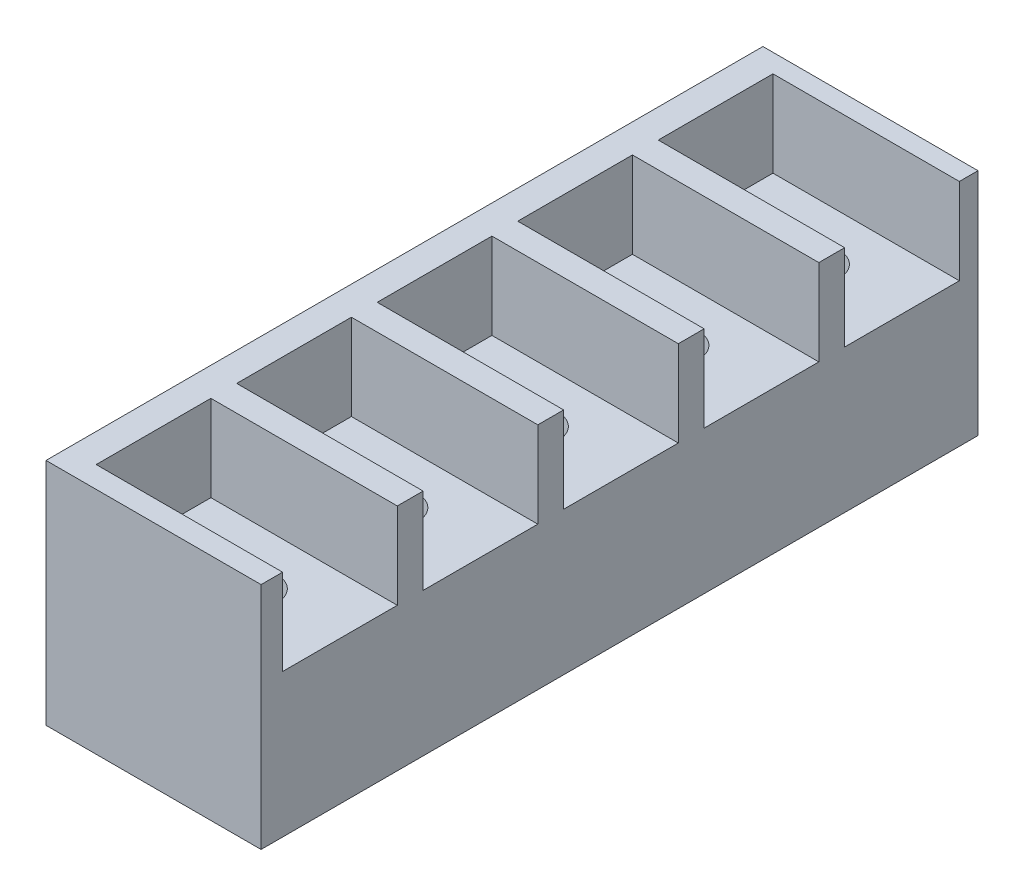
ISO-10303-21;
HEADER;
FILE_DESCRIPTION(('STEP AP214'),'2;1');
FILE_NAME('part.step','',(''),(''),'','','');
FILE_SCHEMA(('AUTOMOTIVE_DESIGN { 1 0 10303 214 1 1 1 1 }'));
ENDSEC;
DATA;
#1=APPLICATION_CONTEXT('core data for automotive mechanical design processes');
#2=APPLICATION_PROTOCOL_DEFINITION('international standard','automotive_design',2000,#1);
#3=PRODUCT_CONTEXT('',#1,'mechanical');
#4=PRODUCT('Part','Part','',(#3));
#5=PRODUCT_RELATED_PRODUCT_CATEGORY('part','',(#4));
#6=PRODUCT_DEFINITION_FORMATION('','',#4);
#7=PRODUCT_DEFINITION_CONTEXT('part definition',#1,'design');
#8=PRODUCT_DEFINITION('design','',#6,#7);
#9=PRODUCT_DEFINITION_SHAPE('','',#8);
#10=(LENGTH_UNIT() NAMED_UNIT(*) SI_UNIT(.MILLI.,.METRE.));
#11=(NAMED_UNIT(*) PLANE_ANGLE_UNIT() SI_UNIT($,.RADIAN.));
#12=(NAMED_UNIT(*) SI_UNIT($,.STERADIAN.) SOLID_ANGLE_UNIT());
#13=UNCERTAINTY_MEASURE_WITH_UNIT(LENGTH_MEASURE(1.E-05),#10,'distance_accuracy_value','');
#14=(GEOMETRIC_REPRESENTATION_CONTEXT(3) GLOBAL_UNCERTAINTY_ASSIGNED_CONTEXT((#13)) GLOBAL_UNIT_ASSIGNED_CONTEXT((#10,
#11,#12)) REPRESENTATION_CONTEXT('',''));
#15=CARTESIAN_POINT('',(0.,0.,0.));
#16=DIRECTION('',(0.,0.,1.));
#17=DIRECTION('',(1.,0.,0.));
#18=AXIS2_PLACEMENT_3D('',#15,#16,#17);
#19=CARTESIAN_POINT('',(0.,16.,0.));
#20=DIRECTION('',(1.,0.,0.));
#21=DIRECTION('',(0.,0.,-1.));
#22=AXIS2_PLACEMENT_3D('',#19,#20,#21);
#23=PLANE('',#22);
#24=DIRECTION('',(0.,0.,1.));
#25=VECTOR('',#24,1.);
#26=CARTESIAN_POINT('',(0.,0.,0.));
#27=LINE('',#26,#25);
#28=CARTESIAN_POINT('',(0.,0.,-50.));
#29=VERTEX_POINT('',#28);
#30=CARTESIAN_POINT('',(0.,0.,0.));
#31=VERTEX_POINT('',#30);
#32=EDGE_CURVE('E274',#29,#31,#27,.T.);
#33=ORIENTED_EDGE('',*,*,#32,.T.);
#34=DIRECTION('',(0.,-1.,0.));
#35=VECTOR('',#34,1.);
#36=CARTESIAN_POINT('',(0.,16.,0.));
#37=LINE('',#36,#35);
#38=CARTESIAN_POINT('',(0.,16.,0.));
#39=VERTEX_POINT('',#38);
#40=EDGE_CURVE('E11',#39,#31,#37,.T.);
#41=ORIENTED_EDGE('',*,*,#40,.F.);
#42=DIRECTION('',(0.,0.,1.));
#43=VECTOR('',#42,1.);
#44=CARTESIAN_POINT('',(0.,16.,0.));
#45=LINE('',#44,#43);
#46=CARTESIAN_POINT('',(0.,16.,-50.));
#47=VERTEX_POINT('',#46);
#48=EDGE_CURVE('E390',#47,#39,#45,.T.);
#49=ORIENTED_EDGE('',*,*,#48,.F.);
#50=DIRECTION('',(0.,-1.,0.));
#51=VECTOR('',#50,1.);
#52=CARTESIAN_POINT('',(0.,16.,-50.));
#53=LINE('',#52,#51);
#54=EDGE_CURVE('E403',#47,#29,#53,.T.);
#55=ORIENTED_EDGE('',*,*,#54,.T.);
#56=EDGE_LOOP('',(#33,#41,#49,#55));
#57=FACE_BOUND('',#56,.T.);
#58=ADVANCED_FACE('F34',(#57),#23,.F.);
#59=CARTESIAN_POINT('',(0.,16.,0.));
#60=DIRECTION('',(0.,0.,-1.));
#61=DIRECTION('',(-1.,0.,0.));
#62=AXIS2_PLACEMENT_3D('',#59,#60,#61);
#63=PLANE('',#62);
#64=DIRECTION('',(1.,0.,0.));
#65=VECTOR('',#64,1.);
#66=CARTESIAN_POINT('',(0.,0.,0.));
#67=LINE('',#66,#65);
#68=CARTESIAN_POINT('',(15.,0.,0.));
#69=VERTEX_POINT('',#68);
#70=EDGE_CURVE('E406',#31,#69,#67,.T.);
#71=ORIENTED_EDGE('',*,*,#70,.T.);
#72=DIRECTION('',(0.,-1.,0.));
#73=VECTOR('',#72,1.);
#74=CARTESIAN_POINT('',(15.,16.,0.));
#75=LINE('',#74,#73);
#76=CARTESIAN_POINT('',(15.,16.,0.));
#77=VERTEX_POINT('',#76);
#78=EDGE_CURVE('E41',#77,#69,#75,.T.);
#79=ORIENTED_EDGE('',*,*,#78,.F.);
#80=DIRECTION('',(1.,0.,0.));
#81=VECTOR('',#80,1.);
#82=CARTESIAN_POINT('',(0.,16.,0.));
#83=LINE('',#82,#81);
#84=EDGE_CURVE('E393',#39,#77,#83,.T.);
#85=ORIENTED_EDGE('',*,*,#84,.F.);
#86=ORIENTED_EDGE('',*,*,#40,.T.);
#87=EDGE_LOOP('',(#71,#79,#85,#86));
#88=FACE_BOUND('',#87,.T.);
#89=ADVANCED_FACE('F514',(#88),#63,.F.);
#90=CARTESIAN_POINT('',(15.,16.,0.));
#91=DIRECTION('',(-1.,0.,0.));
#92=DIRECTION('',(0.,0.,1.));
#93=AXIS2_PLACEMENT_3D('',#90,#91,#92);
#94=PLANE('',#93);
#95=DIRECTION('',(0.,0.,-1.));
#96=VECTOR('',#95,1.);
#97=CARTESIAN_POINT('',(15.,10.,-1.5));
#98=LINE('',#97,#96);
#99=CARTESIAN_POINT('',(15.,10.,-1.5));
#100=VERTEX_POINT('',#99);
#101=CARTESIAN_POINT('',(15.,10.,-9.5));
#102=VERTEX_POINT('',#101);
#103=EDGE_CURVE('E249',#100,#102,#98,.T.);
#104=ORIENTED_EDGE('',*,*,#103,.F.);
#105=DIRECTION('',(0.,1.,0.));
#106=VECTOR('',#105,1.);
#107=CARTESIAN_POINT('',(15.,10.,-1.5));
#108=LINE('',#107,#106);
#109=CARTESIAN_POINT('',(15.,16.,-1.5));
#110=VERTEX_POINT('',#109);
#111=EDGE_CURVE('E271',#100,#110,#108,.T.);
#112=ORIENTED_EDGE('',*,*,#111,.T.);
#113=DIRECTION('',(0.,0.,-1.));
#114=VECTOR('',#113,1.);
#115=CARTESIAN_POINT('',(15.,16.,0.));
#116=LINE('',#115,#114);
#117=EDGE_CURVE('E397',#77,#110,#116,.T.);
#118=ORIENTED_EDGE('',*,*,#117,.F.);
#119=ORIENTED_EDGE('',*,*,#78,.T.);
#120=DIRECTION('',(0.,0.,-1.));
#121=VECTOR('',#120,1.);
#122=CARTESIAN_POINT('',(15.,0.,0.));
#123=LINE('',#122,#121);
#124=CARTESIAN_POINT('',(15.,0.,-50.));
#125=VERTEX_POINT('',#124);
#126=EDGE_CURVE('E408',#69,#125,#123,.T.);
#127=ORIENTED_EDGE('',*,*,#126,.T.);
#128=DIRECTION('',(0.,-1.,0.));
#129=VECTOR('',#128,1.);
#130=CARTESIAN_POINT('',(15.,16.,-50.));
#131=LINE('',#130,#129);
#132=CARTESIAN_POINT('',(15.,16.,-50.));
#133=VERTEX_POINT('',#132);
#134=EDGE_CURVE('E413',#133,#125,#131,.T.);
#135=ORIENTED_EDGE('',*,*,#134,.F.);
#136=CARTESIAN_POINT('',(15.,16.,-48.7));
#137=VERTEX_POINT('',#136);
#138=EDGE_CURVE('E396',#137,#133,#116,.T.);
#139=ORIENTED_EDGE('',*,*,#138,.F.);
#140=DIRECTION('',(0.,1.,0.));
#141=VECTOR('',#140,1.);
#142=CARTESIAN_POINT('',(14.9999999999999,10.,-48.7));
#143=LINE('',#142,#141);
#144=CARTESIAN_POINT('',(14.9999999999999,10.,-48.7));
#145=VERTEX_POINT('',#144);
#146=EDGE_CURVE('E48',#145,#137,#143,.T.);
#147=ORIENTED_EDGE('',*,*,#146,.F.);
#148=DIRECTION('',(0.,0.,-1.));
#149=VECTOR('',#148,1.);
#150=CARTESIAN_POINT('',(14.9999999999999,10.,-40.7));
#151=LINE('',#150,#149);
#152=CARTESIAN_POINT('',(14.9999999999999,10.,-40.7));
#153=VERTEX_POINT('',#152);
#154=EDGE_CURVE('E368',#153,#145,#151,.T.);
#155=ORIENTED_EDGE('',*,*,#154,.F.);
#156=DIRECTION('',(0.,1.,0.));
#157=VECTOR('',#156,1.);
#158=CARTESIAN_POINT('',(14.9999999999999,10.,-40.7));
#159=LINE('',#158,#157);
#160=CARTESIAN_POINT('',(14.9999999999999,16.,-40.7));
#161=VERTEX_POINT('',#160);
#162=EDGE_CURVE('E378',#153,#161,#159,.T.);
#163=ORIENTED_EDGE('',*,*,#162,.T.);
#164=CARTESIAN_POINT('',(15.,16.,-38.9));
#165=VERTEX_POINT('',#164);
#166=EDGE_CURVE('E439',#165,#161,#116,.T.);
#167=ORIENTED_EDGE('',*,*,#166,.F.);
#168=DIRECTION('',(0.,1.,0.));
#169=VECTOR('',#168,1.);
#170=CARTESIAN_POINT('',(14.9999999999999,10.,-38.9));
#171=LINE('',#170,#169);
#172=CARTESIAN_POINT('',(14.9999999999999,10.,-38.9));
#173=VERTEX_POINT('',#172);
#174=EDGE_CURVE('E56',#173,#165,#171,.T.);
#175=ORIENTED_EDGE('',*,*,#174,.F.);
#176=DIRECTION('',(0.,0.,-1.));
#177=VECTOR('',#176,1.);
#178=CARTESIAN_POINT('',(14.9999999999999,10.,-30.9));
#179=LINE('',#178,#177);
#180=CARTESIAN_POINT('',(14.9999999999999,10.,-30.9));
#181=VERTEX_POINT('',#180);
#182=EDGE_CURVE('E341',#181,#173,#179,.T.);
#183=ORIENTED_EDGE('',*,*,#182,.F.);
#184=DIRECTION('',(0.,1.,0.));
#185=VECTOR('',#184,1.);
#186=CARTESIAN_POINT('',(14.9999999999999,10.,-30.9));
#187=LINE('',#186,#185);
#188=CARTESIAN_POINT('',(14.9999999999999,16.,-30.9));
#189=VERTEX_POINT('',#188);
#190=EDGE_CURVE('E351',#181,#189,#187,.T.);
#191=ORIENTED_EDGE('',*,*,#190,.T.);
#192=CARTESIAN_POINT('',(15.,16.,-29.1));
#193=VERTEX_POINT('',#192);
#194=EDGE_CURVE('E441',#193,#189,#116,.T.);
#195=ORIENTED_EDGE('',*,*,#194,.F.);
#196=DIRECTION('',(0.,1.,0.));
#197=VECTOR('',#196,1.);
#198=CARTESIAN_POINT('',(14.9999999999999,10.,-29.1));
#199=LINE('',#198,#197);
#200=CARTESIAN_POINT('',(14.9999999999999,10.,-29.1));
#201=VERTEX_POINT('',#200);
#202=EDGE_CURVE('E334',#201,#193,#199,.T.);
#203=ORIENTED_EDGE('',*,*,#202,.F.);
#204=DIRECTION('',(0.,0.,-1.));
#205=VECTOR('',#204,1.);
#206=CARTESIAN_POINT('',(14.9999999999999,10.,-21.1));
#207=LINE('',#206,#205);
#208=CARTESIAN_POINT('',(14.9999999999999,10.,-21.1));
#209=VERTEX_POINT('',#208);
#210=EDGE_CURVE('E312',#209,#201,#207,.T.);
#211=ORIENTED_EDGE('',*,*,#210,.F.);
#212=DIRECTION('',(0.,1.,0.));
#213=VECTOR('',#212,1.);
#214=CARTESIAN_POINT('',(14.9999999999999,10.,-21.1));
#215=LINE('',#214,#213);
#216=CARTESIAN_POINT('',(14.9999999999999,16.,-21.1));
#217=VERTEX_POINT('',#216);
#218=EDGE_CURVE('E322',#209,#217,#215,.T.);
#219=ORIENTED_EDGE('',*,*,#218,.T.);
#220=CARTESIAN_POINT('',(15.,16.,-19.3));
#221=VERTEX_POINT('',#220);
#222=EDGE_CURVE('E445',#221,#217,#116,.T.);
#223=ORIENTED_EDGE('',*,*,#222,.F.);
#224=DIRECTION('',(0.,1.,0.));
#225=VECTOR('',#224,1.);
#226=CARTESIAN_POINT('',(15.,10.,-19.3));
#227=LINE('',#226,#225);
#228=CARTESIAN_POINT('',(15.,10.,-19.3));
#229=VERTEX_POINT('',#228);
#230=EDGE_CURVE('E305',#229,#221,#227,.T.);
#231=ORIENTED_EDGE('',*,*,#230,.F.);
#232=DIRECTION('',(0.,0.,-1.));
#233=VECTOR('',#232,1.);
#234=CARTESIAN_POINT('',(15.,10.,-11.3));
#235=LINE('',#234,#233);
#236=CARTESIAN_POINT('',(15.,10.,-11.3));
#237=VERTEX_POINT('',#236);
#238=EDGE_CURVE('E283',#237,#229,#235,.T.);
#239=ORIENTED_EDGE('',*,*,#238,.F.);
#240=DIRECTION('',(0.,1.,0.));
#241=VECTOR('',#240,1.);
#242=CARTESIAN_POINT('',(15.,10.,-11.3));
#243=LINE('',#242,#241);
#244=CARTESIAN_POINT('',(15.,16.,-11.3));
#245=VERTEX_POINT('',#244);
#246=EDGE_CURVE('E293',#237,#245,#243,.T.);
#247=ORIENTED_EDGE('',*,*,#246,.T.);
#248=CARTESIAN_POINT('',(15.,16.,-9.5));
#249=VERTEX_POINT('',#248);
#250=EDGE_CURVE('E401',#249,#245,#116,.T.);
#251=ORIENTED_EDGE('',*,*,#250,.F.);
#252=DIRECTION('',(0.,1.,0.));
#253=VECTOR('',#252,1.);
#254=CARTESIAN_POINT('',(15.,10.,-9.5));
#255=LINE('',#254,#253);
#256=EDGE_CURVE('E262',#102,#249,#255,.T.);
#257=ORIENTED_EDGE('',*,*,#256,.F.);
#258=EDGE_LOOP('',(#104,#112,#118,#119,#127,#135,#139,#147,#155,#163,#167,#175,#183,#191,#195,
#203,#211,#219,#223,#231,#239,#247,#251,#257));
#259=FACE_BOUND('',#258,.T.);
#260=ADVANCED_FACE('F421',(#259),#94,.F.);
#261=CARTESIAN_POINT('',(0.,16.,-50.));
#262=DIRECTION('',(0.,0.,1.));
#263=DIRECTION('',(1.,0.,0.));
#264=AXIS2_PLACEMENT_3D('',#261,#262,#263);
#265=PLANE('',#264);
#266=DIRECTION('',(-1.,0.,0.));
#267=VECTOR('',#266,1.);
#268=CARTESIAN_POINT('',(0.,0.,-50.));
#269=LINE('',#268,#267);
#270=EDGE_CURVE('E394',#125,#29,#269,.T.);
#271=ORIENTED_EDGE('',*,*,#270,.T.);
#272=ORIENTED_EDGE('',*,*,#54,.F.);
#273=DIRECTION('',(-1.,0.,0.));
#274=VECTOR('',#273,1.);
#275=CARTESIAN_POINT('',(0.,16.,-50.));
#276=LINE('',#275,#274);
#277=EDGE_CURVE('E400',#133,#47,#276,.T.);
#278=ORIENTED_EDGE('',*,*,#277,.F.);
#279=ORIENTED_EDGE('',*,*,#134,.T.);
#280=EDGE_LOOP('',(#271,#272,#278,#279));
#281=FACE_BOUND('',#280,.T.);
#282=ADVANCED_FACE('F430',(#281),#265,.F.);
#283=CARTESIAN_POINT('',(0.,16.,0.));
#284=DIRECTION('',(0.,-1.,0.));
#285=DIRECTION('',(0.,0.,-1.));
#286=AXIS2_PLACEMENT_3D('',#283,#284,#285);
#287=PLANE('',#286);
#288=ORIENTED_EDGE('',*,*,#117,.T.);
#289=DIRECTION('',(1.,0.,0.));
#290=VECTOR('',#289,1.);
#291=CARTESIAN_POINT('',(15.,16.,-1.5));
#292=LINE('',#291,#290);
#293=CARTESIAN_POINT('',(2.,16.,-1.5));
#294=VERTEX_POINT('',#293);
#295=EDGE_CURVE('E253',#294,#110,#292,.T.);
#296=ORIENTED_EDGE('',*,*,#295,.F.);
#297=DIRECTION('',(0.,0.,1.));
#298=VECTOR('',#297,1.);
#299=CARTESIAN_POINT('',(2.,16.,-1.5));
#300=LINE('',#299,#298);
#301=CARTESIAN_POINT('',(2.,16.,-9.5));
#302=VERTEX_POINT('',#301);
#303=EDGE_CURVE('E266',#302,#294,#300,.T.);
#304=ORIENTED_EDGE('',*,*,#303,.F.);
#305=DIRECTION('',(-1.,0.,0.));
#306=VECTOR('',#305,1.);
#307=CARTESIAN_POINT('',(15.,16.,-9.5));
#308=LINE('',#307,#306);
#309=EDGE_CURVE('E263',#249,#302,#308,.T.);
#310=ORIENTED_EDGE('',*,*,#309,.F.);
#311=ORIENTED_EDGE('',*,*,#250,.T.);
#312=DIRECTION('',(1.,0.,0.));
#313=VECTOR('',#312,1.);
#314=CARTESIAN_POINT('',(15.,16.,-11.3));
#315=LINE('',#314,#313);
#316=CARTESIAN_POINT('',(1.99999999999997,16.,-11.3));
#317=VERTEX_POINT('',#316);
#318=EDGE_CURVE('E294',#317,#245,#315,.T.);
#319=ORIENTED_EDGE('',*,*,#318,.F.);
#320=DIRECTION('',(0.,0.,1.));
#321=VECTOR('',#320,1.);
#322=CARTESIAN_POINT('',(1.99999999999997,16.,-11.3));
#323=LINE('',#322,#321);
#324=CARTESIAN_POINT('',(1.99999999999997,16.,-19.3));
#325=VERTEX_POINT('',#324);
#326=EDGE_CURVE('E284',#325,#317,#323,.T.);
#327=ORIENTED_EDGE('',*,*,#326,.F.);
#328=DIRECTION('',(-1.,0.,0.));
#329=VECTOR('',#328,1.);
#330=CARTESIAN_POINT('',(15.,16.,-19.3));
#331=LINE('',#330,#329);
#332=EDGE_CURVE('E296',#221,#325,#331,.T.);
#333=ORIENTED_EDGE('',*,*,#332,.F.);
#334=ORIENTED_EDGE('',*,*,#222,.T.);
#335=DIRECTION('',(1.,0.,0.));
#336=VECTOR('',#335,1.);
#337=CARTESIAN_POINT('',(14.9999999999999,16.,-21.1));
#338=LINE('',#337,#336);
#339=CARTESIAN_POINT('',(1.99999999999993,16.,-21.1));
#340=VERTEX_POINT('',#339);
#341=EDGE_CURVE('E323',#340,#217,#338,.T.);
#342=ORIENTED_EDGE('',*,*,#341,.F.);
#343=DIRECTION('',(0.,0.,1.));
#344=VECTOR('',#343,1.);
#345=CARTESIAN_POINT('',(1.99999999999993,16.,-21.1));
#346=LINE('',#345,#344);
#347=CARTESIAN_POINT('',(1.99999999999993,16.,-29.1));
#348=VERTEX_POINT('',#347);
#349=EDGE_CURVE('E313',#348,#340,#346,.T.);
#350=ORIENTED_EDGE('',*,*,#349,.F.);
#351=DIRECTION('',(-1.,0.,0.));
#352=VECTOR('',#351,1.);
#353=CARTESIAN_POINT('',(14.9999999999999,16.,-29.1));
#354=LINE('',#353,#352);
#355=EDGE_CURVE('E325',#193,#348,#354,.T.);
#356=ORIENTED_EDGE('',*,*,#355,.F.);
#357=ORIENTED_EDGE('',*,*,#194,.T.);
#358=DIRECTION('',(1.,0.,0.));
#359=VECTOR('',#358,1.);
#360=CARTESIAN_POINT('',(14.9999999999999,16.,-30.9));
#361=LINE('',#360,#359);
#362=CARTESIAN_POINT('',(1.9999999999999,16.,-30.9));
#363=VERTEX_POINT('',#362);
#364=EDGE_CURVE('E352',#363,#189,#361,.T.);
#365=ORIENTED_EDGE('',*,*,#364,.F.);
#366=DIRECTION('',(0.,0.,1.));
#367=VECTOR('',#366,1.);
#368=CARTESIAN_POINT('',(1.9999999999999,16.,-30.9));
#369=LINE('',#368,#367);
#370=CARTESIAN_POINT('',(1.9999999999999,16.,-38.9));
#371=VERTEX_POINT('',#370);
#372=EDGE_CURVE('E342',#371,#363,#369,.T.);
#373=ORIENTED_EDGE('',*,*,#372,.F.);
#374=DIRECTION('',(-1.,0.,0.));
#375=VECTOR('',#374,1.);
#376=CARTESIAN_POINT('',(14.9999999999999,16.,-38.9));
#377=LINE('',#376,#375);
#378=EDGE_CURVE('E354',#165,#371,#377,.T.);
#379=ORIENTED_EDGE('',*,*,#378,.F.);
#380=ORIENTED_EDGE('',*,*,#166,.T.);
#381=DIRECTION('',(1.,0.,0.));
#382=VECTOR('',#381,1.);
#383=CARTESIAN_POINT('',(14.9999999999999,16.,-40.7));
#384=LINE('',#383,#382);
#385=CARTESIAN_POINT('',(1.99999999999986,16.,-40.7));
#386=VERTEX_POINT('',#385);
#387=EDGE_CURVE('E248',#386,#161,#384,.T.);
#388=ORIENTED_EDGE('',*,*,#387,.F.);
#389=DIRECTION('',(0.,0.,1.));
#390=VECTOR('',#389,1.);
#391=CARTESIAN_POINT('',(1.99999999999986,16.,-40.7));
#392=LINE('',#391,#390);
#393=CARTESIAN_POINT('',(1.99999999999986,16.,-48.7));
#394=VERTEX_POINT('',#393);
#395=EDGE_CURVE('E369',#394,#386,#392,.T.);
#396=ORIENTED_EDGE('',*,*,#395,.F.);
#397=DIRECTION('',(-1.,0.,0.));
#398=VECTOR('',#397,1.);
#399=CARTESIAN_POINT('',(14.9999999999999,16.,-48.7));
#400=LINE('',#399,#398);
#401=EDGE_CURVE('E380',#137,#394,#400,.T.);
#402=ORIENTED_EDGE('',*,*,#401,.F.);
#403=ORIENTED_EDGE('',*,*,#138,.T.);
#404=ORIENTED_EDGE('',*,*,#277,.T.);
#405=ORIENTED_EDGE('',*,*,#48,.T.);
#406=ORIENTED_EDGE('',*,*,#84,.T.);
#407=EDGE_LOOP('',(#288,#296,#304,#310,#311,#319,#327,#333,#334,#342,#350,#356,#357,#365,#373,
#379,#380,#388,#396,#402,#403,#404,#405,#406));
#408=FACE_BOUND('',#407,.T.);
#409=ADVANCED_FACE('F436',(#408),#287,.F.);
#410=CARTESIAN_POINT('',(0.,0.,0.));
#411=DIRECTION('',(0.,-1.,0.));
#412=DIRECTION('',(0.,0.,-1.));
#413=AXIS2_PLACEMENT_3D('',#410,#411,#412);
#414=PLANE('',#413);
#415=ORIENTED_EDGE('',*,*,#32,.F.);
#416=ORIENTED_EDGE('',*,*,#270,.F.);
#417=ORIENTED_EDGE('',*,*,#126,.F.);
#418=ORIENTED_EDGE('',*,*,#70,.F.);
#419=EDGE_LOOP('',(#415,#416,#417,#418));
#420=FACE_BOUND('',#419,.T.);
#421=ADVANCED_FACE('F427',(#420),#414,.T.);
#422=CARTESIAN_POINT('',(14.9999999999999,10.,-40.7));
#423=DIRECTION('',(0.,0.,1.));
#424=DIRECTION('',(1.,0.,0.));
#425=AXIS2_PLACEMENT_3D('',#422,#423,#424);
#426=PLANE('',#425);
#427=ORIENTED_EDGE('',*,*,#387,.T.);
#428=ORIENTED_EDGE('',*,*,#162,.F.);
#429=DIRECTION('',(1.,0.,0.));
#430=VECTOR('',#429,1.);
#431=CARTESIAN_POINT('',(14.9999999999999,10.,-40.7));
#432=LINE('',#431,#430);
#433=CARTESIAN_POINT('',(1.99999999999986,10.,-40.7));
#434=VERTEX_POINT('',#433);
#435=EDGE_CURVE('E365',#434,#153,#432,.T.);
#436=ORIENTED_EDGE('',*,*,#435,.F.);
#437=DIRECTION('',(0.,1.,0.));
#438=VECTOR('',#437,1.);
#439=CARTESIAN_POINT('',(1.99999999999986,10.,-40.7));
#440=LINE('',#439,#438);
#441=EDGE_CURVE('E355',#434,#386,#440,.T.);
#442=ORIENTED_EDGE('',*,*,#441,.T.);
#443=EDGE_LOOP('',(#427,#428,#436,#442));
#444=FACE_BOUND('',#443,.T.);
#445=ADVANCED_FACE('F496',(#444),#426,.F.);
#446=CARTESIAN_POINT('',(1.99999999999986,10.,-40.7));
#447=DIRECTION('',(-1.,0.,0.));
#448=DIRECTION('',(0.,0.,1.));
#449=AXIS2_PLACEMENT_3D('',#446,#447,#448);
#450=PLANE('',#449);
#451=ORIENTED_EDGE('',*,*,#395,.T.);
#452=ORIENTED_EDGE('',*,*,#441,.F.);
#453=DIRECTION('',(0.,0.,1.));
#454=VECTOR('',#453,1.);
#455=CARTESIAN_POINT('',(1.99999999999986,10.,-40.7));
#456=LINE('',#455,#454);
#457=CARTESIAN_POINT('',(1.99999999999986,10.,-48.7));
#458=VERTEX_POINT('',#457);
#459=EDGE_CURVE('E375',#458,#434,#456,.T.);
#460=ORIENTED_EDGE('',*,*,#459,.F.);
#461=DIRECTION('',(0.,1.,0.));
#462=VECTOR('',#461,1.);
#463=CARTESIAN_POINT('',(1.99999999999986,10.,-48.7));
#464=LINE('',#463,#462);
#465=EDGE_CURVE('E385',#458,#394,#464,.T.);
#466=ORIENTED_EDGE('',*,*,#465,.T.);
#467=EDGE_LOOP('',(#451,#452,#460,#466));
#468=FACE_BOUND('',#467,.T.);
#469=ADVANCED_FACE('F501',(#468),#450,.F.);
#470=CARTESIAN_POINT('',(14.9999999999999,10.,-48.7));
#471=DIRECTION('',(0.,0.,-1.));
#472=DIRECTION('',(-1.,0.,0.));
#473=AXIS2_PLACEMENT_3D('',#470,#471,#472);
#474=PLANE('',#473);
#475=ORIENTED_EDGE('',*,*,#401,.T.);
#476=ORIENTED_EDGE('',*,*,#465,.F.);
#477=DIRECTION('',(-1.,0.,0.));
#478=VECTOR('',#477,1.);
#479=CARTESIAN_POINT('',(14.9999999999999,10.,-48.7));
#480=LINE('',#479,#478);
#481=EDGE_CURVE('E372',#145,#458,#480,.T.);
#482=ORIENTED_EDGE('',*,*,#481,.F.);
#483=ORIENTED_EDGE('',*,*,#146,.T.);
#484=EDGE_LOOP('',(#475,#476,#482,#483));
#485=FACE_BOUND('',#484,.T.);
#486=ADVANCED_FACE('F502',(#485),#474,.F.);
#487=CARTESIAN_POINT('',(0.,10.,0.));
#488=DIRECTION('',(0.,-1.,0.));
#489=DIRECTION('',(0.,0.,-1.));
#490=AXIS2_PLACEMENT_3D('',#487,#488,#489);
#491=PLANE('',#490);
#492=CARTESIAN_POINT('',(9.,10.,-44.7));
#493=DIRECTION('',(0.,1.,0.));
#494=DIRECTION('',(0.,0.,1.));
#495=AXIS2_PLACEMENT_3D('',#492,#493,#494);
#496=CIRCLE('',#495,1.64999999999999);
#497=CARTESIAN_POINT('',(9.,10.,-43.05));
#498=VERTEX_POINT('',#497);
#499=EDGE_CURVE('E242',#498,#498,#496,.T.);
#500=ORIENTED_EDGE('',*,*,#499,.F.);
#501=EDGE_LOOP('',(#500));
#502=FACE_BOUND('',#501,.T.);
#503=ORIENTED_EDGE('',*,*,#435,.T.);
#504=ORIENTED_EDGE('',*,*,#154,.T.);
#505=ORIENTED_EDGE('',*,*,#481,.T.);
#506=ORIENTED_EDGE('',*,*,#459,.T.);
#507=EDGE_LOOP('',(#503,#504,#505,#506));
#508=FACE_BOUND('',#507,.T.);
#509=ADVANCED_FACE('F498',(#502,#508),#491,.F.);
#510=CARTESIAN_POINT('',(14.9999999999999,10.,-30.9));
#511=DIRECTION('',(0.,0.,1.));
#512=DIRECTION('',(1.,0.,0.));
#513=AXIS2_PLACEMENT_3D('',#510,#511,#512);
#514=PLANE('',#513);
#515=ORIENTED_EDGE('',*,*,#364,.T.);
#516=ORIENTED_EDGE('',*,*,#190,.F.);
#517=DIRECTION('',(1.,0.,0.));
#518=VECTOR('',#517,1.);
#519=CARTESIAN_POINT('',(14.9999999999999,10.,-30.9));
#520=LINE('',#519,#518);
#521=CARTESIAN_POINT('',(1.9999999999999,10.,-30.9));
#522=VERTEX_POINT('',#521);
#523=EDGE_CURVE('E338',#522,#181,#520,.T.);
#524=ORIENTED_EDGE('',*,*,#523,.F.);
#525=DIRECTION('',(0.,1.,0.));
#526=VECTOR('',#525,1.);
#527=CARTESIAN_POINT('',(1.9999999999999,10.,-30.9));
#528=LINE('',#527,#526);
#529=EDGE_CURVE('E326',#522,#363,#528,.T.);
#530=ORIENTED_EDGE('',*,*,#529,.T.);
#531=EDGE_LOOP('',(#515,#516,#524,#530));
#532=FACE_BOUND('',#531,.T.);
#533=ADVANCED_FACE('F486',(#532),#514,.F.);
#534=CARTESIAN_POINT('',(1.9999999999999,10.,-30.9));
#535=DIRECTION('',(-1.,0.,0.));
#536=DIRECTION('',(0.,0.,1.));
#537=AXIS2_PLACEMENT_3D('',#534,#535,#536);
#538=PLANE('',#537);
#539=ORIENTED_EDGE('',*,*,#372,.T.);
#540=ORIENTED_EDGE('',*,*,#529,.F.);
#541=DIRECTION('',(0.,0.,1.));
#542=VECTOR('',#541,1.);
#543=CARTESIAN_POINT('',(1.9999999999999,10.,-30.9));
#544=LINE('',#543,#542);
#545=CARTESIAN_POINT('',(1.9999999999999,10.,-38.9));
#546=VERTEX_POINT('',#545);
#547=EDGE_CURVE('E348',#546,#522,#544,.T.);
#548=ORIENTED_EDGE('',*,*,#547,.F.);
#549=DIRECTION('',(0.,1.,0.));
#550=VECTOR('',#549,1.);
#551=CARTESIAN_POINT('',(1.9999999999999,10.,-38.9));
#552=LINE('',#551,#550);
#553=EDGE_CURVE('E360',#546,#371,#552,.T.);
#554=ORIENTED_EDGE('',*,*,#553,.T.);
#555=EDGE_LOOP('',(#539,#540,#548,#554));
#556=FACE_BOUND('',#555,.T.);
#557=ADVANCED_FACE('F491',(#556),#538,.F.);
#558=CARTESIAN_POINT('',(14.9999999999999,10.,-38.9));
#559=DIRECTION('',(0.,0.,-1.));
#560=DIRECTION('',(-1.,0.,0.));
#561=AXIS2_PLACEMENT_3D('',#558,#559,#560);
#562=PLANE('',#561);
#563=ORIENTED_EDGE('',*,*,#378,.T.);
#564=ORIENTED_EDGE('',*,*,#553,.F.);
#565=DIRECTION('',(-1.,0.,0.));
#566=VECTOR('',#565,1.);
#567=CARTESIAN_POINT('',(14.9999999999999,10.,-38.9));
#568=LINE('',#567,#566);
#569=EDGE_CURVE('E345',#173,#546,#568,.T.);
#570=ORIENTED_EDGE('',*,*,#569,.F.);
#571=ORIENTED_EDGE('',*,*,#174,.T.);
#572=EDGE_LOOP('',(#563,#564,#570,#571));
#573=FACE_BOUND('',#572,.T.);
#574=ADVANCED_FACE('F560',(#573),#562,.F.);
#575=CARTESIAN_POINT('',(0.,10.,0.));
#576=DIRECTION('',(0.,-1.,0.));
#577=DIRECTION('',(0.,0.,-1.));
#578=AXIS2_PLACEMENT_3D('',#575,#576,#577);
#579=PLANE('',#578);
#580=CARTESIAN_POINT('',(9.,10.,-34.9));
#581=DIRECTION('',(0.,1.,0.));
#582=DIRECTION('',(0.,0.,1.));
#583=AXIS2_PLACEMENT_3D('',#580,#581,#582);
#584=CIRCLE('',#583,1.64999999999999);
#585=CARTESIAN_POINT('',(9.,10.,-33.25));
#586=VERTEX_POINT('',#585);
#587=EDGE_CURVE('E236',#586,#586,#584,.T.);
#588=ORIENTED_EDGE('',*,*,#587,.F.);
#589=EDGE_LOOP('',(#588));
#590=FACE_BOUND('',#589,.T.);
#591=ORIENTED_EDGE('',*,*,#523,.T.);
#592=ORIENTED_EDGE('',*,*,#182,.T.);
#593=ORIENTED_EDGE('',*,*,#569,.T.);
#594=ORIENTED_EDGE('',*,*,#547,.T.);
#595=EDGE_LOOP('',(#591,#592,#593,#594));
#596=FACE_BOUND('',#595,.T.);
#597=ADVANCED_FACE('F488',(#590,#596),#579,.F.);
#598=CARTESIAN_POINT('',(14.9999999999999,10.,-21.1));
#599=DIRECTION('',(0.,0.,1.));
#600=DIRECTION('',(1.,0.,0.));
#601=AXIS2_PLACEMENT_3D('',#598,#599,#600);
#602=PLANE('',#601);
#603=ORIENTED_EDGE('',*,*,#341,.T.);
#604=ORIENTED_EDGE('',*,*,#218,.F.);
#605=DIRECTION('',(1.,0.,0.));
#606=VECTOR('',#605,1.);
#607=CARTESIAN_POINT('',(14.9999999999999,10.,-21.1));
#608=LINE('',#607,#606);
#609=CARTESIAN_POINT('',(1.99999999999993,10.,-21.1));
#610=VERTEX_POINT('',#609);
#611=EDGE_CURVE('E309',#610,#209,#608,.T.);
#612=ORIENTED_EDGE('',*,*,#611,.F.);
#613=DIRECTION('',(0.,1.,0.));
#614=VECTOR('',#613,1.);
#615=CARTESIAN_POINT('',(1.99999999999993,10.,-21.1));
#616=LINE('',#615,#614);
#617=EDGE_CURVE('E297',#610,#340,#616,.T.);
#618=ORIENTED_EDGE('',*,*,#617,.T.);
#619=EDGE_LOOP('',(#603,#604,#612,#618));
#620=FACE_BOUND('',#619,.T.);
#621=ADVANCED_FACE('F475',(#620),#602,.F.);
#622=CARTESIAN_POINT('',(1.99999999999993,10.,-21.1));
#623=DIRECTION('',(-1.,0.,0.));
#624=DIRECTION('',(0.,0.,1.));
#625=AXIS2_PLACEMENT_3D('',#622,#623,#624);
#626=PLANE('',#625);
#627=ORIENTED_EDGE('',*,*,#349,.T.);
#628=ORIENTED_EDGE('',*,*,#617,.F.);
#629=DIRECTION('',(0.,0.,1.));
#630=VECTOR('',#629,1.);
#631=CARTESIAN_POINT('',(1.99999999999993,10.,-21.1));
#632=LINE('',#631,#630);
#633=CARTESIAN_POINT('',(1.99999999999993,10.,-29.1));
#634=VERTEX_POINT('',#633);
#635=EDGE_CURVE('E319',#634,#610,#632,.T.);
#636=ORIENTED_EDGE('',*,*,#635,.F.);
#637=DIRECTION('',(0.,1.,0.));
#638=VECTOR('',#637,1.);
#639=CARTESIAN_POINT('',(1.99999999999993,10.,-29.1));
#640=LINE('',#639,#638);
#641=EDGE_CURVE('E332',#634,#348,#640,.T.);
#642=ORIENTED_EDGE('',*,*,#641,.T.);
#643=EDGE_LOOP('',(#627,#628,#636,#642));
#644=FACE_BOUND('',#643,.T.);
#645=ADVANCED_FACE('F480',(#644),#626,.F.);
#646=CARTESIAN_POINT('',(14.9999999999999,10.,-29.1));
#647=DIRECTION('',(0.,0.,-1.));
#648=DIRECTION('',(-1.,0.,0.));
#649=AXIS2_PLACEMENT_3D('',#646,#647,#648);
#650=PLANE('',#649);
#651=ORIENTED_EDGE('',*,*,#355,.T.);
#652=ORIENTED_EDGE('',*,*,#641,.F.);
#653=DIRECTION('',(-1.,0.,0.));
#654=VECTOR('',#653,1.);
#655=CARTESIAN_POINT('',(14.9999999999999,10.,-29.1));
#656=LINE('',#655,#654);
#657=EDGE_CURVE('E316',#201,#634,#656,.T.);
#658=ORIENTED_EDGE('',*,*,#657,.F.);
#659=ORIENTED_EDGE('',*,*,#202,.T.);
#660=EDGE_LOOP('',(#651,#652,#658,#659));
#661=FACE_BOUND('',#660,.T.);
#662=ADVANCED_FACE('F587',(#661),#650,.F.);
#663=CARTESIAN_POINT('',(0.,10.,0.));
#664=DIRECTION('',(0.,-1.,0.));
#665=DIRECTION('',(0.,0.,-1.));
#666=AXIS2_PLACEMENT_3D('',#663,#664,#665);
#667=PLANE('',#666);
#668=CARTESIAN_POINT('',(9.,10.,-25.1));
#669=DIRECTION('',(0.,1.,0.));
#670=DIRECTION('',(0.,0.,1.));
#671=AXIS2_PLACEMENT_3D('',#668,#669,#670);
#672=CIRCLE('',#671,1.64999999999999);
#673=CARTESIAN_POINT('',(9.,10.,-23.45));
#674=VERTEX_POINT('',#673);
#675=EDGE_CURVE('E230',#674,#674,#672,.T.);
#676=ORIENTED_EDGE('',*,*,#675,.F.);
#677=EDGE_LOOP('',(#676));
#678=FACE_BOUND('',#677,.T.);
#679=ORIENTED_EDGE('',*,*,#611,.T.);
#680=ORIENTED_EDGE('',*,*,#210,.T.);
#681=ORIENTED_EDGE('',*,*,#657,.T.);
#682=ORIENTED_EDGE('',*,*,#635,.T.);
#683=EDGE_LOOP('',(#679,#680,#681,#682));
#684=FACE_BOUND('',#683,.T.);
#685=ADVANCED_FACE('F477',(#678,#684),#667,.F.);
#686=CARTESIAN_POINT('',(15.,10.,-11.3));
#687=DIRECTION('',(0.,0.,1.));
#688=DIRECTION('',(1.,0.,0.));
#689=AXIS2_PLACEMENT_3D('',#686,#687,#688);
#690=PLANE('',#689);
#691=ORIENTED_EDGE('',*,*,#318,.T.);
#692=ORIENTED_EDGE('',*,*,#246,.F.);
#693=DIRECTION('',(1.,0.,0.));
#694=VECTOR('',#693,1.);
#695=CARTESIAN_POINT('',(15.,10.,-11.3));
#696=LINE('',#695,#694);
#697=CARTESIAN_POINT('',(1.99999999999997,10.,-11.3));
#698=VERTEX_POINT('',#697);
#699=EDGE_CURVE('E280',#698,#237,#696,.T.);
#700=ORIENTED_EDGE('',*,*,#699,.F.);
#701=DIRECTION('',(0.,1.,0.));
#702=VECTOR('',#701,1.);
#703=CARTESIAN_POINT('',(1.99999999999997,10.,-11.3));
#704=LINE('',#703,#702);
#705=EDGE_CURVE('E267',#698,#317,#704,.T.);
#706=ORIENTED_EDGE('',*,*,#705,.T.);
#707=EDGE_LOOP('',(#691,#692,#700,#706));
#708=FACE_BOUND('',#707,.T.);
#709=ADVANCED_FACE('F464',(#708),#690,.F.);
#710=CARTESIAN_POINT('',(1.99999999999997,10.,-11.3));
#711=DIRECTION('',(-1.,0.,0.));
#712=DIRECTION('',(0.,0.,1.));
#713=AXIS2_PLACEMENT_3D('',#710,#711,#712);
#714=PLANE('',#713);
#715=ORIENTED_EDGE('',*,*,#326,.T.);
#716=ORIENTED_EDGE('',*,*,#705,.F.);
#717=DIRECTION('',(0.,0.,1.));
#718=VECTOR('',#717,1.);
#719=CARTESIAN_POINT('',(1.99999999999997,10.,-11.3));
#720=LINE('',#719,#718);
#721=CARTESIAN_POINT('',(1.99999999999997,10.,-19.3));
#722=VERTEX_POINT('',#721);
#723=EDGE_CURVE('E290',#722,#698,#720,.T.);
#724=ORIENTED_EDGE('',*,*,#723,.F.);
#725=DIRECTION('',(0.,1.,0.));
#726=VECTOR('',#725,1.);
#727=CARTESIAN_POINT('',(1.99999999999997,10.,-19.3));
#728=LINE('',#727,#726);
#729=EDGE_CURVE('E303',#722,#325,#728,.T.);
#730=ORIENTED_EDGE('',*,*,#729,.T.);
#731=EDGE_LOOP('',(#715,#716,#724,#730));
#732=FACE_BOUND('',#731,.T.);
#733=ADVANCED_FACE('F469',(#732),#714,.F.);
#734=CARTESIAN_POINT('',(15.,10.,-19.3));
#735=DIRECTION('',(0.,0.,-1.));
#736=DIRECTION('',(-1.,0.,0.));
#737=AXIS2_PLACEMENT_3D('',#734,#735,#736);
#738=PLANE('',#737);
#739=ORIENTED_EDGE('',*,*,#332,.T.);
#740=ORIENTED_EDGE('',*,*,#729,.F.);
#741=DIRECTION('',(-1.,0.,0.));
#742=VECTOR('',#741,1.);
#743=CARTESIAN_POINT('',(15.,10.,-19.3));
#744=LINE('',#743,#742);
#745=EDGE_CURVE('E287',#229,#722,#744,.T.);
#746=ORIENTED_EDGE('',*,*,#745,.F.);
#747=ORIENTED_EDGE('',*,*,#230,.T.);
#748=EDGE_LOOP('',(#739,#740,#746,#747));
#749=FACE_BOUND('',#748,.T.);
#750=ADVANCED_FACE('F614',(#749),#738,.F.);
#751=CARTESIAN_POINT('',(0.,10.,0.));
#752=DIRECTION('',(0.,-1.,0.));
#753=DIRECTION('',(0.,0.,-1.));
#754=AXIS2_PLACEMENT_3D('',#751,#752,#753);
#755=PLANE('',#754);
#756=CARTESIAN_POINT('',(9.,10.,-15.3));
#757=DIRECTION('',(0.,1.,0.));
#758=DIRECTION('',(0.,0.,1.));
#759=AXIS2_PLACEMENT_3D('',#756,#757,#758);
#760=CIRCLE('',#759,1.64999999999999);
#761=CARTESIAN_POINT('',(9.,10.,-13.65));
#762=VERTEX_POINT('',#761);
#763=EDGE_CURVE('E219',#762,#762,#760,.T.);
#764=ORIENTED_EDGE('',*,*,#763,.F.);
#765=EDGE_LOOP('',(#764));
#766=FACE_BOUND('',#765,.T.);
#767=ORIENTED_EDGE('',*,*,#699,.T.);
#768=ORIENTED_EDGE('',*,*,#238,.T.);
#769=ORIENTED_EDGE('',*,*,#745,.T.);
#770=ORIENTED_EDGE('',*,*,#723,.T.);
#771=EDGE_LOOP('',(#767,#768,#769,#770));
#772=FACE_BOUND('',#771,.T.);
#773=ADVANCED_FACE('F466',(#766,#772),#755,.F.);
#774=CARTESIAN_POINT('',(15.,10.,-1.5));
#775=DIRECTION('',(0.,0.,1.));
#776=DIRECTION('',(1.,0.,0.));
#777=AXIS2_PLACEMENT_3D('',#774,#775,#776);
#778=PLANE('',#777);
#779=ORIENTED_EDGE('',*,*,#295,.T.);
#780=ORIENTED_EDGE('',*,*,#111,.F.);
#781=DIRECTION('',(1.,0.,0.));
#782=VECTOR('',#781,1.);
#783=CARTESIAN_POINT('',(15.,10.,-1.5));
#784=LINE('',#783,#782);
#785=CARTESIAN_POINT('',(2.,10.,-1.5));
#786=VERTEX_POINT('',#785);
#787=EDGE_CURVE('E259',#786,#100,#784,.T.);
#788=ORIENTED_EDGE('',*,*,#787,.F.);
#789=DIRECTION('',(0.,1.,0.));
#790=VECTOR('',#789,1.);
#791=CARTESIAN_POINT('',(2.,10.,-1.5));
#792=LINE('',#791,#790);
#793=EDGE_CURVE('E275',#786,#294,#792,.T.);
#794=ORIENTED_EDGE('',*,*,#793,.T.);
#795=EDGE_LOOP('',(#779,#780,#788,#794));
#796=FACE_BOUND('',#795,.T.);
#797=ADVANCED_FACE('F629',(#796),#778,.F.);
#798=CARTESIAN_POINT('',(2.,10.,-1.5));
#799=DIRECTION('',(-1.,0.,0.));
#800=DIRECTION('',(0.,0.,1.));
#801=AXIS2_PLACEMENT_3D('',#798,#799,#800);
#802=PLANE('',#801);
#803=ORIENTED_EDGE('',*,*,#303,.T.);
#804=ORIENTED_EDGE('',*,*,#793,.F.);
#805=DIRECTION('',(0.,0.,1.));
#806=VECTOR('',#805,1.);
#807=CARTESIAN_POINT('',(2.,10.,-1.5));
#808=LINE('',#807,#806);
#809=CARTESIAN_POINT('',(2.,10.,-9.5));
#810=VERTEX_POINT('',#809);
#811=EDGE_CURVE('E256',#810,#786,#808,.T.);
#812=ORIENTED_EDGE('',*,*,#811,.F.);
#813=DIRECTION('',(0.,1.,0.));
#814=VECTOR('',#813,1.);
#815=CARTESIAN_POINT('',(2.,10.,-9.5));
#816=LINE('',#815,#814);
#817=EDGE_CURVE('E277',#810,#302,#816,.T.);
#818=ORIENTED_EDGE('',*,*,#817,.T.);
#819=EDGE_LOOP('',(#803,#804,#812,#818));
#820=FACE_BOUND('',#819,.T.);
#821=ADVANCED_FACE('F634',(#820),#802,.F.);
#822=CARTESIAN_POINT('',(15.,10.,-9.5));
#823=DIRECTION('',(0.,0.,-1.));
#824=DIRECTION('',(-1.,0.,0.));
#825=AXIS2_PLACEMENT_3D('',#822,#823,#824);
#826=PLANE('',#825);
#827=ORIENTED_EDGE('',*,*,#309,.T.);
#828=ORIENTED_EDGE('',*,*,#817,.F.);
#829=DIRECTION('',(-1.,0.,0.));
#830=VECTOR('',#829,1.);
#831=CARTESIAN_POINT('',(15.,10.,-9.5));
#832=LINE('',#831,#830);
#833=EDGE_CURVE('E252',#102,#810,#832,.T.);
#834=ORIENTED_EDGE('',*,*,#833,.F.);
#835=ORIENTED_EDGE('',*,*,#256,.T.);
#836=EDGE_LOOP('',(#827,#828,#834,#835));
#837=FACE_BOUND('',#836,.T.);
#838=ADVANCED_FACE('F644',(#837),#826,.F.);
#839=CARTESIAN_POINT('',(0.,10.,0.));
#840=DIRECTION('',(0.,1.,0.));
#841=DIRECTION('',(0.,0.,1.));
#842=AXIS2_PLACEMENT_3D('',#839,#840,#841);
#843=PLANE('',#842);
#844=CARTESIAN_POINT('',(9.,10.,-5.5));
#845=DIRECTION('',(0.,1.,0.));
#846=DIRECTION('',(0.,0.,1.));
#847=AXIS2_PLACEMENT_3D('',#844,#845,#846);
#848=CIRCLE('',#847,1.64999999999999);
#849=CARTESIAN_POINT('',(9.,10.,-3.85000000000001));
#850=VERTEX_POINT('',#849);
#851=EDGE_CURVE('E220',#850,#850,#848,.T.);
#852=ORIENTED_EDGE('',*,*,#851,.F.);
#853=EDGE_LOOP('',(#852));
#854=FACE_BOUND('',#853,.T.);
#855=ORIENTED_EDGE('',*,*,#103,.T.);
#856=ORIENTED_EDGE('',*,*,#833,.T.);
#857=ORIENTED_EDGE('',*,*,#811,.T.);
#858=ORIENTED_EDGE('',*,*,#787,.T.);
#859=EDGE_LOOP('',(#855,#856,#857,#858));
#860=FACE_BOUND('',#859,.T.);
#861=ADVANCED_FACE('F654',(#854,#860),#843,.T.);
#862=CARTESIAN_POINT('',(9.,4.,-44.7));
#863=DIRECTION('',(0.,1.,0.));
#864=DIRECTION('',(0.,0.,1.));
#865=AXIS2_PLACEMENT_3D('',#862,#863,#864);
#866=CONICAL_SURFACE('',#865,1.65,1.02974425867665);
#867=CARTESIAN_POINT('',(9.,3.00857997860453,-44.7));
#868=VERTEX_POINT('',#867);
#869=VERTEX_LOOP('',#868);
#870=FACE_BOUND('',#869,.T.);
#871=CARTESIAN_POINT('',(9.,4.,-44.7));
#872=DIRECTION('',(0.,1.,0.));
#873=DIRECTION('',(0.,0.,1.));
#874=AXIS2_PLACEMENT_3D('',#871,#872,#873);
#875=CIRCLE('',#874,1.65);
#876=CARTESIAN_POINT('',(9.,4.,-43.05));
#877=VERTEX_POINT('',#876);
#878=EDGE_CURVE('E245',#877,#877,#875,.T.);
#879=ORIENTED_EDGE('',*,*,#878,.T.);
#880=EDGE_LOOP('',(#879));
#881=FACE_BOUND('',#880,.T.);
#882=ADVANCED_FACE('F690',(#870,#881),#866,.F.);
#883=CARTESIAN_POINT('',(9.,10.,-44.7));
#884=DIRECTION('',(0.,1.,0.));
#885=DIRECTION('',(0.,0.,1.));
#886=AXIS2_PLACEMENT_3D('',#883,#884,#885);
#887=CYLINDRICAL_SURFACE('',#886,1.64999999999999);
#888=ORIENTED_EDGE('',*,*,#878,.F.);
#889=EDGE_LOOP('',(#888));
#890=FACE_BOUND('',#889,.T.);
#891=ORIENTED_EDGE('',*,*,#499,.T.);
#892=EDGE_LOOP('',(#891));
#893=FACE_BOUND('',#892,.T.);
#894=ADVANCED_FACE('F700',(#890,#893),#887,.F.);
#895=CARTESIAN_POINT('',(9.,4.,-34.9));
#896=DIRECTION('',(0.,1.,0.));
#897=DIRECTION('',(0.,0.,1.));
#898=AXIS2_PLACEMENT_3D('',#895,#896,#897);
#899=CONICAL_SURFACE('',#898,1.65,1.02974425867665);
#900=CARTESIAN_POINT('',(9.,3.00857997860453,-34.9));
#901=VERTEX_POINT('',#900);
#902=VERTEX_LOOP('',#901);
#903=FACE_BOUND('',#902,.T.);
#904=CARTESIAN_POINT('',(9.,4.,-34.9));
#905=DIRECTION('',(0.,1.,0.));
#906=DIRECTION('',(0.,0.,1.));
#907=AXIS2_PLACEMENT_3D('',#904,#905,#906);
#908=CIRCLE('',#907,1.65);
#909=CARTESIAN_POINT('',(9.,4.,-33.25));
#910=VERTEX_POINT('',#909);
#911=EDGE_CURVE('E239',#910,#910,#908,.T.);
#912=ORIENTED_EDGE('',*,*,#911,.T.);
#913=EDGE_LOOP('',(#912));
#914=FACE_BOUND('',#913,.T.);
#915=ADVANCED_FACE('F711',(#903,#914),#899,.F.);
#916=CARTESIAN_POINT('',(9.,10.,-34.9));
#917=DIRECTION('',(0.,1.,0.));
#918=DIRECTION('',(0.,0.,1.));
#919=AXIS2_PLACEMENT_3D('',#916,#917,#918);
#920=CYLINDRICAL_SURFACE('',#919,1.64999999999999);
#921=ORIENTED_EDGE('',*,*,#911,.F.);
#922=EDGE_LOOP('',(#921));
#923=FACE_BOUND('',#922,.T.);
#924=ORIENTED_EDGE('',*,*,#587,.T.);
#925=EDGE_LOOP('',(#924));
#926=FACE_BOUND('',#925,.T.);
#927=ADVANCED_FACE('F722',(#923,#926),#920,.F.);
#928=CARTESIAN_POINT('',(9.,4.,-25.1));
#929=DIRECTION('',(0.,1.,0.));
#930=DIRECTION('',(0.,0.,1.));
#931=AXIS2_PLACEMENT_3D('',#928,#929,#930);
#932=CONICAL_SURFACE('',#931,1.65,1.02974425867665);
#933=CARTESIAN_POINT('',(9.,3.00857997860453,-25.1));
#934=VERTEX_POINT('',#933);
#935=VERTEX_LOOP('',#934);
#936=FACE_BOUND('',#935,.T.);
#937=CARTESIAN_POINT('',(9.,4.,-25.1));
#938=DIRECTION('',(0.,1.,0.));
#939=DIRECTION('',(0.,0.,1.));
#940=AXIS2_PLACEMENT_3D('',#937,#938,#939);
#941=CIRCLE('',#940,1.65);
#942=CARTESIAN_POINT('',(9.,4.,-23.45));
#943=VERTEX_POINT('',#942);
#944=EDGE_CURVE('E233',#943,#943,#941,.T.);
#945=ORIENTED_EDGE('',*,*,#944,.T.);
#946=EDGE_LOOP('',(#945));
#947=FACE_BOUND('',#946,.T.);
#948=ADVANCED_FACE('F732',(#936,#947),#932,.F.);
#949=CARTESIAN_POINT('',(9.,10.,-25.1));
#950=DIRECTION('',(0.,1.,0.));
#951=DIRECTION('',(0.,0.,1.));
#952=AXIS2_PLACEMENT_3D('',#949,#950,#951);
#953=CYLINDRICAL_SURFACE('',#952,1.64999999999999);
#954=ORIENTED_EDGE('',*,*,#944,.F.);
#955=EDGE_LOOP('',(#954));
#956=FACE_BOUND('',#955,.T.);
#957=ORIENTED_EDGE('',*,*,#675,.T.);
#958=EDGE_LOOP('',(#957));
#959=FACE_BOUND('',#958,.T.);
#960=ADVANCED_FACE('F743',(#956,#959),#953,.F.);
#961=CARTESIAN_POINT('',(9.,4.,-15.3));
#962=DIRECTION('',(0.,1.,0.));
#963=DIRECTION('',(0.,0.,1.));
#964=AXIS2_PLACEMENT_3D('',#961,#962,#963);
#965=CONICAL_SURFACE('',#964,1.65,1.02974425867665);
#966=CARTESIAN_POINT('',(9.,3.00857997860453,-15.3));
#967=VERTEX_POINT('',#966);
#968=VERTEX_LOOP('',#967);
#969=FACE_BOUND('',#968,.T.);
#970=CARTESIAN_POINT('',(9.,4.,-15.3));
#971=DIRECTION('',(0.,1.,0.));
#972=DIRECTION('',(0.,0.,1.));
#973=AXIS2_PLACEMENT_3D('',#970,#971,#972);
#974=CIRCLE('',#973,1.65);
#975=CARTESIAN_POINT('',(9.,4.,-13.65));
#976=VERTEX_POINT('',#975);
#977=EDGE_CURVE('E223',#976,#976,#974,.T.);
#978=ORIENTED_EDGE('',*,*,#977,.T.);
#979=EDGE_LOOP('',(#978));
#980=FACE_BOUND('',#979,.T.);
#981=ADVANCED_FACE('F753',(#969,#980),#965,.F.);
#982=CARTESIAN_POINT('',(9.,10.,-15.3));
#983=DIRECTION('',(0.,1.,0.));
#984=DIRECTION('',(0.,0.,1.));
#985=AXIS2_PLACEMENT_3D('',#982,#983,#984);
#986=CYLINDRICAL_SURFACE('',#985,1.64999999999999);
#987=ORIENTED_EDGE('',*,*,#977,.F.);
#988=EDGE_LOOP('',(#987));
#989=FACE_BOUND('',#988,.T.);
#990=ORIENTED_EDGE('',*,*,#763,.T.);
#991=EDGE_LOOP('',(#990));
#992=FACE_BOUND('',#991,.T.);
#993=ADVANCED_FACE('F213',(#989,#992),#986,.F.);
#994=CARTESIAN_POINT('',(9.,4.,-5.5));
#995=DIRECTION('',(0.,1.,0.));
#996=DIRECTION('',(0.,0.,1.));
#997=AXIS2_PLACEMENT_3D('',#994,#995,#996);
#998=CONICAL_SURFACE('',#997,1.65,1.02974425867665);
#999=CARTESIAN_POINT('',(9.,3.00857997860453,-5.5));
#1000=VERTEX_POINT('',#999);
#1001=VERTEX_LOOP('',#1000);
#1002=FACE_BOUND('',#1001,.T.);
#1003=CARTESIAN_POINT('',(9.,4.,-5.5));
#1004=DIRECTION('',(0.,1.,0.));
#1005=DIRECTION('',(0.,0.,1.));
#1006=AXIS2_PLACEMENT_3D('',#1003,#1004,#1005);
#1007=CIRCLE('',#1006,1.65);
#1008=CARTESIAN_POINT('',(9.,4.,-3.85));
#1009=VERTEX_POINT('',#1008);
#1010=EDGE_CURVE('E217',#1009,#1009,#1007,.T.);
#1011=ORIENTED_EDGE('',*,*,#1010,.T.);
#1012=EDGE_LOOP('',(#1011));
#1013=FACE_BOUND('',#1012,.T.);
#1014=ADVANCED_FACE('F209',(#1002,#1013),#998,.F.);
#1015=CARTESIAN_POINT('',(9.,10.,-5.5));
#1016=DIRECTION('',(0.,1.,0.));
#1017=DIRECTION('',(0.,0.,1.));
#1018=AXIS2_PLACEMENT_3D('',#1015,#1016,#1017);
#1019=CYLINDRICAL_SURFACE('',#1018,1.64999999999999);
#1020=ORIENTED_EDGE('',*,*,#1010,.F.);
#1021=EDGE_LOOP('',(#1020));
#1022=FACE_BOUND('',#1021,.T.);
#1023=ORIENTED_EDGE('',*,*,#851,.T.);
#1024=EDGE_LOOP('',(#1023));
#1025=FACE_BOUND('',#1024,.T.);
#1026=ADVANCED_FACE('F212',(#1022,#1025),#1019,.F.);
#1027=CLOSED_SHELL('',(#58,#89,#260,#282,#409,#421,#445,#469,#486,#509,#533,#557,#574,#597,#621,
#645,#662,#685,#709,#733,#750,#773,#797,#821,#838,#861,#882,#894,#915,#927,#948,#960,#981,#993,
#1014,#1026));
#1028=MANIFOLD_SOLID_BREP('B2',#1027);
#1029=ADVANCED_BREP_SHAPE_REPRESENTATION('',(#18,#1028),#14);
#1030=SHAPE_DEFINITION_REPRESENTATION(#9,#1029);
ENDSEC;
END-ISO-10303-21;
